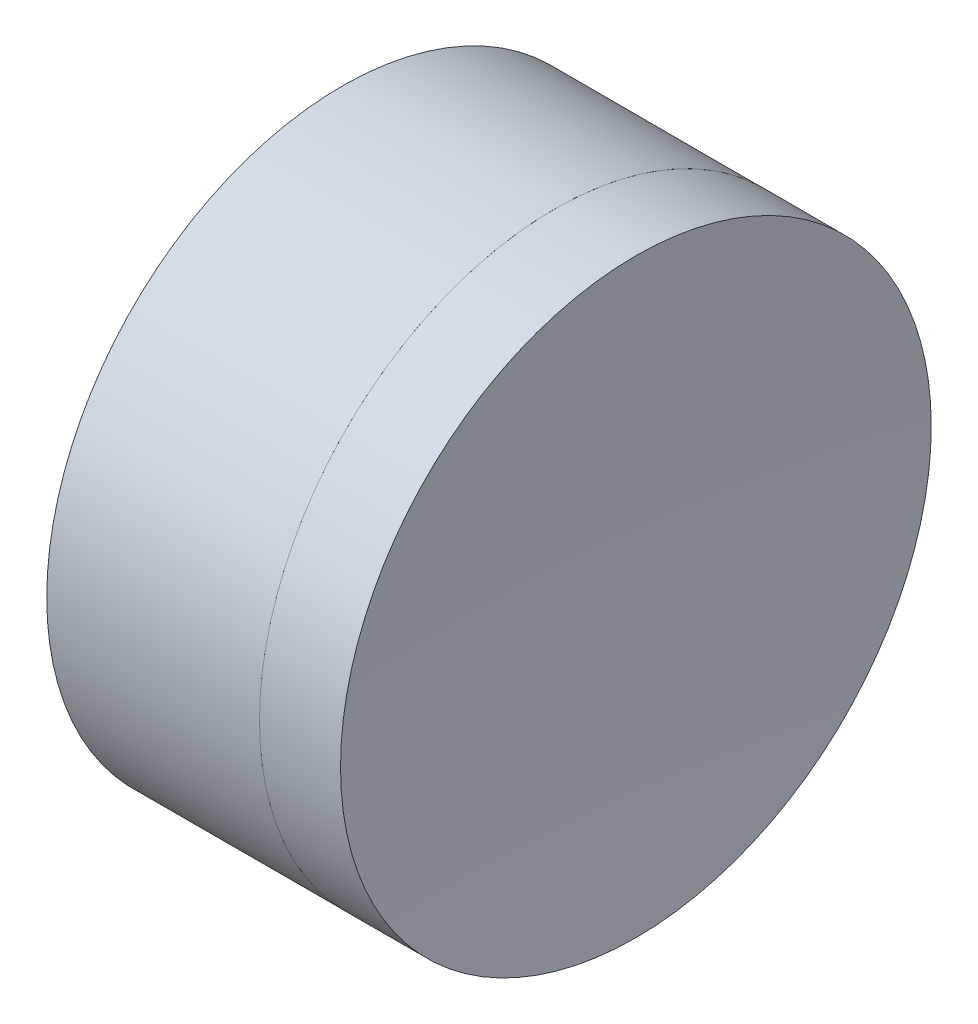
ISO-10303-21;
HEADER;
FILE_DESCRIPTION(('STEP AP214'),'2;1');
FILE_NAME('part.step','',(''),(''),'','','');
FILE_SCHEMA(('AUTOMOTIVE_DESIGN { 1 0 10303 214 1 1 1 1 }'));
ENDSEC;
DATA;
#1=APPLICATION_CONTEXT('core data for automotive mechanical design processes');
#2=APPLICATION_PROTOCOL_DEFINITION('international standard','automotive_design',2000,#1);
#3=PRODUCT_CONTEXT('',#1,'mechanical');
#4=PRODUCT('Part','Part','',(#3));
#5=PRODUCT_RELATED_PRODUCT_CATEGORY('part','',(#4));
#6=PRODUCT_DEFINITION_FORMATION('','',#4);
#7=PRODUCT_DEFINITION_CONTEXT('part definition',#1,'design');
#8=PRODUCT_DEFINITION('design','',#6,#7);
#9=PRODUCT_DEFINITION_SHAPE('','',#8);
#10=(LENGTH_UNIT() NAMED_UNIT(*) SI_UNIT(.MILLI.,.METRE.));
#11=(NAMED_UNIT(*) PLANE_ANGLE_UNIT() SI_UNIT($,.RADIAN.));
#12=(NAMED_UNIT(*) SI_UNIT($,.STERADIAN.) SOLID_ANGLE_UNIT());
#13=UNCERTAINTY_MEASURE_WITH_UNIT(LENGTH_MEASURE(1.E-05),#10,'distance_accuracy_value','');
#14=(GEOMETRIC_REPRESENTATION_CONTEXT(3) GLOBAL_UNCERTAINTY_ASSIGNED_CONTEXT((#13)) GLOBAL_UNIT_ASSIGNED_CONTEXT((#10,
#11,#12)) REPRESENTATION_CONTEXT('',''));
#15=CARTESIAN_POINT('',(0.,0.,0.));
#16=DIRECTION('',(0.,0.,1.));
#17=DIRECTION('',(1.,0.,0.));
#18=AXIS2_PLACEMENT_3D('',#15,#16,#17);
#19=CARTESIAN_POINT('',(245.700599441558,0.,0.));
#20=DIRECTION('',(-1.,0.,0.));
#21=DIRECTION('',(0.,0.,1.));
#22=AXIS2_PLACEMENT_3D('',#19,#20,#21);
#23=SPHERICAL_SURFACE('',#22,14.3);
#24=CARTESIAN_POINT('',(232.887812859398,0.,0.));
#25=DIRECTION('',(-1.,0.,0.));
#26=DIRECTION('',(0.,0.,1.));
#27=AXIS2_PLACEMENT_3D('',#24,#25,#26);
#28=CIRCLE('',#27,6.34999999999999);
#29=CARTESIAN_POINT('',(232.887812859398,0.,6.34999999999999));
#30=VERTEX_POINT('',#29);
#31=EDGE_CURVE('E11',#30,#30,#28,.T.);
#32=ORIENTED_EDGE('',*,*,#31,.T.);
#33=EDGE_LOOP('',(#32));
#34=FACE_BOUND('',#33,.T.);
#35=ADVANCED_FACE('F45',(#34),#23,.T.);
#36=CARTESIAN_POINT('',(228.313932308561,0.,0.));
#37=DIRECTION('',(-1.,0.,0.));
#38=DIRECTION('',(0.,0.,1.));
#39=AXIS2_PLACEMENT_3D('',#36,#37,#38);
#40=CYLINDRICAL_SURFACE('',#39,6.35);
#41=CARTESIAN_POINT('',(234.630265234371,0.,0.));
#42=DIRECTION('',(-1.,0.,0.));
#43=DIRECTION('',(0.,0.,1.));
#44=AXIS2_PLACEMENT_3D('',#41,#42,#43);
#45=CIRCLE('',#44,6.35);
#46=CARTESIAN_POINT('',(234.630265234371,0.,6.35));
#47=VERTEX_POINT('',#46);
#48=EDGE_CURVE('E51',#47,#47,#45,.T.);
#49=ORIENTED_EDGE('',*,*,#48,.T.);
#50=EDGE_LOOP('',(#49));
#51=FACE_BOUND('',#50,.T.);
#52=ORIENTED_EDGE('',*,*,#31,.F.);
#53=EDGE_LOOP('',(#52));
#54=FACE_BOUND('',#53,.T.);
#55=ADVANCED_FACE('F57',(#51,#54),#40,.T.);
#56=CARTESIAN_POINT('',(322.300599441558,0.,0.));
#57=DIRECTION('',(-1.,0.,0.));
#58=DIRECTION('',(0.,0.,-1.));
#59=AXIS2_PLACEMENT_3D('',#56,#57,#58);
#60=SPHERICAL_SURFACE('',#59,87.9);
#61=ORIENTED_EDGE('',*,*,#48,.F.);
#62=EDGE_LOOP('',(#61));
#63=FACE_BOUND('',#62,.T.);
#64=ADVANCED_FACE('F60',(#63),#60,.F.);
#65=CLOSED_SHELL('',(#35,#55,#64));
#66=MANIFOLD_SOLID_BREP('B2',#65);
#67=CARTESIAN_POINT('',(216.400599441558,0.,0.));
#68=DIRECTION('',(-1.,0.,0.));
#69=DIRECTION('',(0.,0.,1.));
#70=AXIS2_PLACEMENT_3D('',#67,#68,#69);
#71=SPHERICAL_SURFACE('',#70,13.5);
#72=CARTESIAN_POINT('',(228.313932308561,0.,0.));
#73=DIRECTION('',(-1.,0.,0.));
#74=DIRECTION('',(0.,0.,1.));
#75=AXIS2_PLACEMENT_3D('',#72,#73,#74);
#76=CIRCLE('',#75,6.35000000000004);
#77=CARTESIAN_POINT('',(228.313932308561,0.,6.35));
#78=VERTEX_POINT('',#77);
#79=EDGE_CURVE('E44',#78,#78,#76,.T.);
#80=ORIENTED_EDGE('',*,*,#79,.T.);
#81=EDGE_LOOP('',(#80));
#82=FACE_BOUND('',#81,.T.);
#83=ADVANCED_FACE('F86',(#82),#71,.F.);
#84=CARTESIAN_POINT('',(-0.816062176165804,0.,0.));
#85=DIRECTION('',(-1.,0.,0.));
#86=DIRECTION('',(0.,0.,1.));
#87=AXIS2_PLACEMENT_3D('',#84,#85,#86);
#88=CYLINDRICAL_SURFACE('',#87,6.35000000000004);
#89=CARTESIAN_POINT('',(232.887812859398,0.,0.));
#90=DIRECTION('',(-1.,0.,0.));
#91=DIRECTION('',(0.,0.,1.));
#92=AXIS2_PLACEMENT_3D('',#89,#90,#91);
#93=CIRCLE('',#92,6.35000000000004);
#94=CARTESIAN_POINT('',(232.887812859398,0.,6.35));
#95=VERTEX_POINT('',#94);
#96=EDGE_CURVE('E92',#95,#95,#93,.T.);
#97=ORIENTED_EDGE('',*,*,#96,.T.);
#98=EDGE_LOOP('',(#97));
#99=FACE_BOUND('',#98,.T.);
#100=ORIENTED_EDGE('',*,*,#79,.F.);
#101=EDGE_LOOP('',(#100));
#102=FACE_BOUND('',#101,.T.);
#103=ADVANCED_FACE('F98',(#99,#102),#88,.T.);
#104=CARTESIAN_POINT('',(245.700599441558,0.,0.));
#105=DIRECTION('',(-1.,0.,0.));
#106=DIRECTION('',(0.,0.,-1.));
#107=AXIS2_PLACEMENT_3D('',#104,#105,#106);
#108=SPHERICAL_SURFACE('',#107,14.3);
#109=ORIENTED_EDGE('',*,*,#96,.F.);
#110=EDGE_LOOP('',(#109));
#111=FACE_BOUND('',#110,.T.);
#112=ADVANCED_FACE('F101',(#111),#108,.F.);
#113=CLOSED_SHELL('',(#83,#103,#112));
#114=MANIFOLD_SOLID_BREP('B6',#113);
#115=ADVANCED_BREP_SHAPE_REPRESENTATION('',(#18,#66,#114),#14);
#116=SHAPE_DEFINITION_REPRESENTATION(#9,#115);
ENDSEC;
END-ISO-10303-21;
